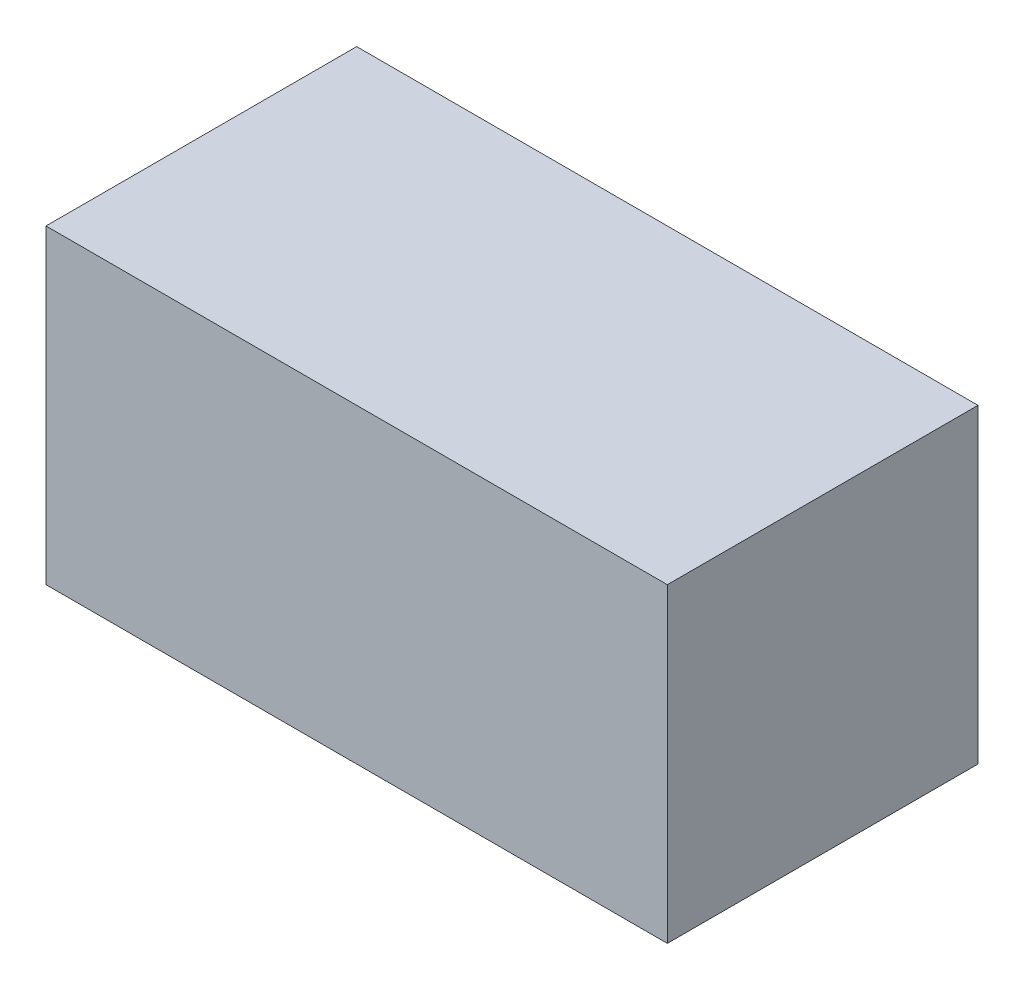
ISO-10303-21;
HEADER;
FILE_DESCRIPTION(('STEP AP214'),'2;1');
FILE_NAME('part.step','',(''),(''),'','','');
FILE_SCHEMA(('AUTOMOTIVE_DESIGN { 1 0 10303 214 1 1 1 1 }'));
ENDSEC;
DATA;
#1=APPLICATION_CONTEXT('core data for automotive mechanical design processes');
#2=APPLICATION_PROTOCOL_DEFINITION('international standard','automotive_design',2000,#1);
#3=PRODUCT_CONTEXT('',#1,'mechanical');
#4=PRODUCT('Part','Part','',(#3));
#5=PRODUCT_RELATED_PRODUCT_CATEGORY('part','',(#4));
#6=PRODUCT_DEFINITION_FORMATION('','',#4);
#7=PRODUCT_DEFINITION_CONTEXT('part definition',#1,'design');
#8=PRODUCT_DEFINITION('design','',#6,#7);
#9=PRODUCT_DEFINITION_SHAPE('','',#8);
#10=(LENGTH_UNIT() NAMED_UNIT(*) SI_UNIT(.MILLI.,.METRE.));
#11=(NAMED_UNIT(*) PLANE_ANGLE_UNIT() SI_UNIT($,.RADIAN.));
#12=(NAMED_UNIT(*) SI_UNIT($,.STERADIAN.) SOLID_ANGLE_UNIT());
#13=UNCERTAINTY_MEASURE_WITH_UNIT(LENGTH_MEASURE(1.E-05),#10,'distance_accuracy_value','');
#14=(GEOMETRIC_REPRESENTATION_CONTEXT(3) GLOBAL_UNCERTAINTY_ASSIGNED_CONTEXT((#13)) GLOBAL_UNIT_ASSIGNED_CONTEXT((#10,
#11,#12)) REPRESENTATION_CONTEXT('',''));
#15=CARTESIAN_POINT('',(0.,0.,0.));
#16=DIRECTION('',(0.,0.,1.));
#17=DIRECTION('',(1.,0.,0.));
#18=AXIS2_PLACEMENT_3D('',#15,#16,#17);
#19=CARTESIAN_POINT('',(-51.5386359456207,30.5551905920519,5.));
#20=DIRECTION('',(0.,-1.,0.));
#21=DIRECTION('',(0.,0.,-1.));
#22=AXIS2_PLACEMENT_3D('',#19,#20,#21);
#23=PLANE('',#22);
#24=DIRECTION('',(-1.,0.,0.));
#25=VECTOR('',#24,1.);
#26=CARTESIAN_POINT('',(-51.5386359456207,30.5551905920519,0.));
#27=LINE('',#26,#25);
#28=CARTESIAN_POINT('',(-41.5386359456207,30.5551905920519,0.));
#29=VERTEX_POINT('',#28);
#30=CARTESIAN_POINT('',(-51.5386359456207,30.5551905920519,0.));
#31=VERTEX_POINT('',#30);
#32=EDGE_CURVE('E96',#29,#31,#27,.T.);
#33=ORIENTED_EDGE('',*,*,#32,.T.);
#34=DIRECTION('',(0.,0.,-1.));
#35=VECTOR('',#34,1.);
#36=CARTESIAN_POINT('',(-51.5386359456207,30.5551905920519,5.));
#37=LINE('',#36,#35);
#38=CARTESIAN_POINT('',(-51.5386359456207,30.5551905920519,5.));
#39=VERTEX_POINT('',#38);
#40=EDGE_CURVE('E11',#39,#31,#37,.T.);
#41=ORIENTED_EDGE('',*,*,#40,.F.);
#42=DIRECTION('',(-1.,0.,0.));
#43=VECTOR('',#42,1.);
#44=CARTESIAN_POINT('',(-51.5386359456207,30.5551905920519,5.));
#45=LINE('',#44,#43);
#46=CARTESIAN_POINT('',(-41.5386359456207,30.5551905920519,5.));
#47=VERTEX_POINT('',#46);
#48=EDGE_CURVE('E84',#47,#39,#45,.T.);
#49=ORIENTED_EDGE('',*,*,#48,.F.);
#50=DIRECTION('',(0.,0.,-1.));
#51=VECTOR('',#50,1.);
#52=CARTESIAN_POINT('',(-41.5386359456207,30.5551905920519,5.));
#53=LINE('',#52,#51);
#54=EDGE_CURVE('E92',#47,#29,#53,.T.);
#55=ORIENTED_EDGE('',*,*,#54,.T.);
#56=EDGE_LOOP('',(#33,#41,#49,#55));
#57=FACE_BOUND('',#56,.T.);
#58=ADVANCED_FACE('F33',(#57),#23,.F.);
#59=CARTESIAN_POINT('',(-51.5386359456207,30.5551905920519,5.));
#60=DIRECTION('',(1.,0.,0.));
#61=DIRECTION('',(0.,0.,-1.));
#62=AXIS2_PLACEMENT_3D('',#59,#60,#61);
#63=PLANE('',#62);
#64=DIRECTION('',(0.,-1.,0.));
#65=VECTOR('',#64,1.);
#66=CARTESIAN_POINT('',(-51.5386359456207,30.5551905920519,0.));
#67=LINE('',#66,#65);
#68=CARTESIAN_POINT('',(-51.5386359456207,25.5551905920519,0.));
#69=VERTEX_POINT('',#68);
#70=EDGE_CURVE('E88',#31,#69,#67,.T.);
#71=ORIENTED_EDGE('',*,*,#70,.T.);
#72=DIRECTION('',(0.,0.,-1.));
#73=VECTOR('',#72,1.);
#74=CARTESIAN_POINT('',(-51.5386359456207,25.5551905920519,5.));
#75=LINE('',#74,#73);
#76=CARTESIAN_POINT('',(-51.5386359456207,25.5551905920519,5.));
#77=VERTEX_POINT('',#76);
#78=EDGE_CURVE('E41',#77,#69,#75,.T.);
#79=ORIENTED_EDGE('',*,*,#78,.F.);
#80=DIRECTION('',(0.,-1.,0.));
#81=VECTOR('',#80,1.);
#82=CARTESIAN_POINT('',(-51.5386359456207,30.5551905920519,5.));
#83=LINE('',#82,#81);
#84=EDGE_CURVE('E79',#39,#77,#83,.T.);
#85=ORIENTED_EDGE('',*,*,#84,.F.);
#86=ORIENTED_EDGE('',*,*,#40,.T.);
#87=EDGE_LOOP('',(#71,#79,#85,#86));
#88=FACE_BOUND('',#87,.T.);
#89=ADVANCED_FACE('F87',(#88),#63,.F.);
#90=CARTESIAN_POINT('',(-51.5386359456207,25.5551905920519,5.));
#91=DIRECTION('',(0.,1.,0.));
#92=DIRECTION('',(0.,0.,1.));
#93=AXIS2_PLACEMENT_3D('',#90,#91,#92);
#94=PLANE('',#93);
#95=DIRECTION('',(1.,0.,0.));
#96=VECTOR('',#95,1.);
#97=CARTESIAN_POINT('',(-51.5386359456207,25.5551905920519,0.));
#98=LINE('',#97,#96);
#99=CARTESIAN_POINT('',(-41.5386359456207,25.5551905920519,0.));
#100=VERTEX_POINT('',#99);
#101=EDGE_CURVE('E66',#69,#100,#98,.T.);
#102=ORIENTED_EDGE('',*,*,#101,.T.);
#103=DIRECTION('',(0.,0.,-1.));
#104=VECTOR('',#103,1.);
#105=CARTESIAN_POINT('',(-41.5386359456207,25.5551905920519,5.));
#106=LINE('',#105,#104);
#107=CARTESIAN_POINT('',(-41.5386359456207,25.5551905920519,5.));
#108=VERTEX_POINT('',#107);
#109=EDGE_CURVE('E89',#108,#100,#106,.T.);
#110=ORIENTED_EDGE('',*,*,#109,.F.);
#111=DIRECTION('',(1.,0.,0.));
#112=VECTOR('',#111,1.);
#113=CARTESIAN_POINT('',(-51.5386359456207,25.5551905920519,5.));
#114=LINE('',#113,#112);
#115=EDGE_CURVE('E82',#77,#108,#114,.T.);
#116=ORIENTED_EDGE('',*,*,#115,.F.);
#117=ORIENTED_EDGE('',*,*,#78,.T.);
#118=EDGE_LOOP('',(#102,#110,#116,#117));
#119=FACE_BOUND('',#118,.T.);
#120=ADVANCED_FACE('F90',(#119),#94,.F.);
#121=CARTESIAN_POINT('',(-41.5386359456207,30.5551905920519,5.));
#122=DIRECTION('',(-1.,0.,0.));
#123=DIRECTION('',(0.,0.,1.));
#124=AXIS2_PLACEMENT_3D('',#121,#122,#123);
#125=PLANE('',#124);
#126=DIRECTION('',(0.,1.,0.));
#127=VECTOR('',#126,1.);
#128=CARTESIAN_POINT('',(-41.5386359456207,30.5551905920519,0.));
#129=LINE('',#128,#127);
#130=EDGE_CURVE('E72',#100,#29,#129,.T.);
#131=ORIENTED_EDGE('',*,*,#130,.T.);
#132=ORIENTED_EDGE('',*,*,#54,.F.);
#133=DIRECTION('',(0.,1.,0.));
#134=VECTOR('',#133,1.);
#135=CARTESIAN_POINT('',(-41.5386359456207,30.5551905920519,5.));
#136=LINE('',#135,#134);
#137=EDGE_CURVE('E49',#108,#47,#136,.T.);
#138=ORIENTED_EDGE('',*,*,#137,.F.);
#139=ORIENTED_EDGE('',*,*,#109,.T.);
#140=EDGE_LOOP('',(#131,#132,#138,#139));
#141=FACE_BOUND('',#140,.T.);
#142=ADVANCED_FACE('F103',(#141),#125,.F.);
#143=CARTESIAN_POINT('',(0.,0.,5.));
#144=DIRECTION('',(0.,0.,-1.));
#145=DIRECTION('',(-1.,0.,0.));
#146=AXIS2_PLACEMENT_3D('',#143,#144,#145);
#147=PLANE('',#146);
#148=ORIENTED_EDGE('',*,*,#48,.T.);
#149=ORIENTED_EDGE('',*,*,#84,.T.);
#150=ORIENTED_EDGE('',*,*,#115,.T.);
#151=ORIENTED_EDGE('',*,*,#137,.T.);
#152=EDGE_LOOP('',(#148,#149,#150,#151));
#153=FACE_BOUND('',#152,.T.);
#154=ADVANCED_FACE('F80',(#153),#147,.F.);
#155=CARTESIAN_POINT('',(0.,0.,0.));
#156=DIRECTION('',(0.,0.,-1.));
#157=DIRECTION('',(-1.,0.,0.));
#158=AXIS2_PLACEMENT_3D('',#155,#156,#157);
#159=PLANE('',#158);
#160=ORIENTED_EDGE('',*,*,#32,.F.);
#161=ORIENTED_EDGE('',*,*,#130,.F.);
#162=ORIENTED_EDGE('',*,*,#101,.F.);
#163=ORIENTED_EDGE('',*,*,#70,.F.);
#164=EDGE_LOOP('',(#160,#161,#162,#163));
#165=FACE_BOUND('',#164,.T.);
#166=ADVANCED_FACE('F106',(#165),#159,.T.);
#167=CLOSED_SHELL('',(#58,#89,#120,#142,#154,#166));
#168=MANIFOLD_SOLID_BREP('B2',#167);
#169=ADVANCED_BREP_SHAPE_REPRESENTATION('',(#18,#168),#14);
#170=SHAPE_DEFINITION_REPRESENTATION(#9,#169);
ENDSEC;
END-ISO-10303-21;
